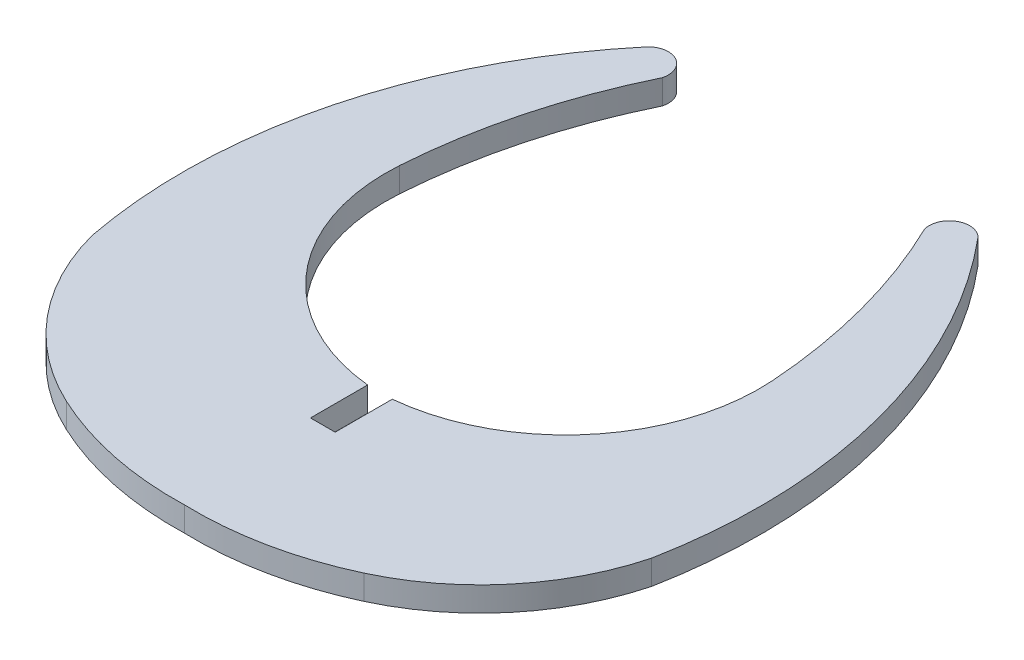
ISO-10303-21;
HEADER;
FILE_DESCRIPTION(('STEP AP214'),'2;1');
FILE_NAME('part.step','',(''),(''),'','','');
FILE_SCHEMA(('AUTOMOTIVE_DESIGN { 1 0 10303 214 1 1 1 1 }'));
ENDSEC;
DATA;
#1=APPLICATION_CONTEXT('core data for automotive mechanical design processes');
#2=APPLICATION_PROTOCOL_DEFINITION('international standard','automotive_design',2000,#1);
#3=PRODUCT_CONTEXT('',#1,'mechanical');
#4=PRODUCT('Part','Part','',(#3));
#5=PRODUCT_RELATED_PRODUCT_CATEGORY('part','',(#4));
#6=PRODUCT_DEFINITION_FORMATION('','',#4);
#7=PRODUCT_DEFINITION_CONTEXT('part definition',#1,'design');
#8=PRODUCT_DEFINITION('design','',#6,#7);
#9=PRODUCT_DEFINITION_SHAPE('','',#8);
#10=(LENGTH_UNIT() NAMED_UNIT(*) SI_UNIT(.MILLI.,.METRE.));
#11=(NAMED_UNIT(*) PLANE_ANGLE_UNIT() SI_UNIT($,.RADIAN.));
#12=(NAMED_UNIT(*) SI_UNIT($,.STERADIAN.) SOLID_ANGLE_UNIT());
#13=UNCERTAINTY_MEASURE_WITH_UNIT(LENGTH_MEASURE(1.E-05),#10,'distance_accuracy_value','');
#14=(GEOMETRIC_REPRESENTATION_CONTEXT(3) GLOBAL_UNCERTAINTY_ASSIGNED_CONTEXT((#13)) GLOBAL_UNIT_ASSIGNED_CONTEXT((#10,
#11,#12)) REPRESENTATION_CONTEXT('',''));
#15=CARTESIAN_POINT('',(0.,0.,0.));
#16=DIRECTION('',(0.,0.,1.));
#17=DIRECTION('',(1.,0.,0.));
#18=AXIS2_PLACEMENT_3D('',#15,#16,#17);
#19=CARTESIAN_POINT('',(154.28905108657,1.45,-331.360232357667));
#20=DIRECTION('',(0.,-1.,0.));
#21=DIRECTION('',(0.,0.,-1.));
#22=AXIS2_PLACEMENT_3D('',#19,#20,#21);
#23=CYLINDRICAL_SURFACE('',#22,31.366578355628);
#24=CARTESIAN_POINT('',(154.28905108657,0.,-331.360232357667));
#25=DIRECTION('',(0.,1.,0.));
#26=DIRECTION('',(0.,0.,1.));
#27=AXIS2_PLACEMENT_3D('',#24,#25,#26);
#28=CIRCLE('',#27,31.366578355628);
#29=CARTESIAN_POINT('',(185.093714546335,0.,-325.449653124599));
#30=VERTEX_POINT('',#29);
#31=CARTESIAN_POINT('',(178.321888119356,0.,-351.516744503753));
#32=VERTEX_POINT('',#31);
#33=EDGE_CURVE('E175',#30,#32,#28,.T.);
#34=ORIENTED_EDGE('',*,*,#33,.T.);
#35=DIRECTION('',(0.,-1.,0.));
#36=VECTOR('',#35,1.);
#37=CARTESIAN_POINT('',(178.321888119356,1.45,-351.516744503753));
#38=LINE('',#37,#36);
#39=CARTESIAN_POINT('',(178.321888119356,1.45,-351.516744503753));
#40=VERTEX_POINT('',#39);
#41=EDGE_CURVE('E11',#40,#32,#38,.T.);
#42=ORIENTED_EDGE('',*,*,#41,.F.);
#43=CARTESIAN_POINT('',(154.28905108657,1.45,-331.360232357667));
#44=DIRECTION('',(0.,1.,0.));
#45=DIRECTION('',(0.,0.,1.));
#46=AXIS2_PLACEMENT_3D('',#43,#44,#45);
#47=CIRCLE('',#46,31.366578355628);
#48=CARTESIAN_POINT('',(185.093714546335,1.45,-325.449653124599));
#49=VERTEX_POINT('',#48);
#50=EDGE_CURVE('E211',#49,#40,#47,.T.);
#51=ORIENTED_EDGE('',*,*,#50,.F.);
#52=DIRECTION('',(0.,-1.,0.));
#53=VECTOR('',#52,1.);
#54=CARTESIAN_POINT('',(185.093714546335,1.45,-325.449653124599));
#55=LINE('',#54,#53);
#56=EDGE_CURVE('E171',#49,#30,#55,.T.);
#57=ORIENTED_EDGE('',*,*,#56,.T.);
#58=EDGE_LOOP('',(#34,#42,#51,#57));
#59=FACE_BOUND('',#58,.T.);
#60=ADVANCED_FACE('F37',(#59),#23,.T.);
#61=CARTESIAN_POINT('',(177.470326971299,1.45,-350.675840287727));
#62=DIRECTION('',(0.,-1.,0.));
#63=DIRECTION('',(0.,0.,-1.));
#64=AXIS2_PLACEMENT_3D('',#61,#62,#63);
#65=CYLINDRICAL_SURFACE('',#64,1.19677746027014);
#66=CARTESIAN_POINT('',(177.470326971299,0.,-350.675840287727));
#67=DIRECTION('',(0.,1.,0.));
#68=DIRECTION('',(0.,0.,1.));
#69=AXIS2_PLACEMENT_3D('',#66,#67,#68);
#70=CIRCLE('',#69,1.19677746027014);
#71=CARTESIAN_POINT('',(176.313887699132,0.,-350.367742090394));
#72=VERTEX_POINT('',#71);
#73=EDGE_CURVE('E178',#32,#72,#70,.T.);
#74=ORIENTED_EDGE('',*,*,#73,.T.);
#75=DIRECTION('',(0.,-1.,0.));
#76=VECTOR('',#75,1.);
#77=CARTESIAN_POINT('',(176.313887699132,1.45,-350.367742090394));
#78=LINE('',#77,#76);
#79=CARTESIAN_POINT('',(176.313887699132,1.45,-350.367742090394));
#80=VERTEX_POINT('',#79);
#81=EDGE_CURVE('E45',#80,#72,#78,.T.);
#82=ORIENTED_EDGE('',*,*,#81,.F.);
#83=CARTESIAN_POINT('',(177.470326971299,1.45,-350.675840287727));
#84=DIRECTION('',(0.,1.,0.));
#85=DIRECTION('',(0.,0.,1.));
#86=AXIS2_PLACEMENT_3D('',#83,#84,#85);
#87=CIRCLE('',#86,1.19677746027014);
#88=EDGE_CURVE('E117',#40,#80,#87,.T.);
#89=ORIENTED_EDGE('',*,*,#88,.F.);
#90=ORIENTED_EDGE('',*,*,#41,.T.);
#91=EDGE_LOOP('',(#74,#82,#89,#90));
#92=FACE_BOUND('',#91,.T.);
#93=ADVANCED_FACE('F240',(#92),#65,.T.);
#94=CARTESIAN_POINT('',(146.282259436417,1.45,-335.798319366719));
#95=DIRECTION('',(0.,-1.,0.));
#96=DIRECTION('',(0.,0.,-1.));
#97=AXIS2_PLACEMENT_3D('',#94,#95,#96);
#98=CYLINDRICAL_SURFACE('',#97,33.379136816446);
#99=CARTESIAN_POINT('',(146.282259436417,0.,-335.798319366719));
#100=DIRECTION('',(0.,1.,0.));
#101=DIRECTION('',(0.,0.,1.));
#102=AXIS2_PLACEMENT_3D('',#99,#100,#101);
#103=CIRCLE('',#102,33.379136816446);
#104=CARTESIAN_POINT('',(179.58178791371,0.,-338.102267673646));
#105=VERTEX_POINT('',#104);
#106=EDGE_CURVE('E181',#105,#72,#103,.T.);
#107=ORIENTED_EDGE('',*,*,#106,.F.);
#108=DIRECTION('',(0.,-1.,0.));
#109=VECTOR('',#108,1.);
#110=CARTESIAN_POINT('',(179.58178791371,1.45,-338.102267673646));
#111=LINE('',#110,#109);
#112=CARTESIAN_POINT('',(179.58178791371,1.45,-338.102267673646));
#113=VERTEX_POINT('',#112);
#114=EDGE_CURVE('E233',#113,#105,#111,.T.);
#115=ORIENTED_EDGE('',*,*,#114,.F.);
#116=CARTESIAN_POINT('',(146.282259436417,1.45,-335.798319366719));
#117=DIRECTION('',(0.,1.,0.));
#118=DIRECTION('',(0.,0.,1.));
#119=AXIS2_PLACEMENT_3D('',#116,#117,#118);
#120=CIRCLE('',#119,33.379136816446);
#121=EDGE_CURVE('E239',#113,#80,#120,.T.);
#122=ORIENTED_EDGE('',*,*,#121,.T.);
#123=ORIENTED_EDGE('',*,*,#81,.T.);
#124=EDGE_LOOP('',(#107,#115,#122,#123));
#125=FACE_BOUND('',#124,.T.);
#126=ADVANCED_FACE('F237',(#125),#98,.F.);
#127=CARTESIAN_POINT('',(168.164118064278,1.45,-337.312295327684));
#128=DIRECTION('',(0.,-1.,0.));
#129=DIRECTION('',(0.,0.,-1.));
#130=AXIS2_PLACEMENT_3D('',#127,#128,#129);
#131=CYLINDRICAL_SURFACE('',#130,11.444965753466);
#132=CARTESIAN_POINT('',(168.164118064278,0.,-337.312295327684));
#133=DIRECTION('',(0.,1.,0.));
#134=DIRECTION('',(0.,0.,1.));
#135=AXIS2_PLACEMENT_3D('',#132,#133,#134);
#136=CIRCLE('',#135,11.444965753466);
#137=CARTESIAN_POINT('',(169.293804043056,0.,-325.923219391184));
#138=VERTEX_POINT('',#137);
#139=EDGE_CURVE('E184',#138,#105,#136,.T.);
#140=ORIENTED_EDGE('',*,*,#139,.F.);
#141=DIRECTION('',(0.,-1.,0.));
#142=VECTOR('',#141,1.);
#143=CARTESIAN_POINT('',(169.293804043056,1.45,-325.923219391184));
#144=LINE('',#143,#142);
#145=CARTESIAN_POINT('',(169.293804043056,1.45,-325.923219391184));
#146=VERTEX_POINT('',#145);
#147=EDGE_CURVE('E231',#146,#138,#144,.T.);
#148=ORIENTED_EDGE('',*,*,#147,.F.);
#149=CARTESIAN_POINT('',(168.164118064278,1.45,-337.312295327684));
#150=DIRECTION('',(0.,1.,0.));
#151=DIRECTION('',(0.,0.,1.));
#152=AXIS2_PLACEMENT_3D('',#149,#150,#151);
#153=CIRCLE('',#152,11.444965753466);
#154=EDGE_CURVE('E251',#146,#113,#153,.T.);
#155=ORIENTED_EDGE('',*,*,#154,.T.);
#156=ORIENTED_EDGE('',*,*,#114,.T.);
#157=EDGE_LOOP('',(#140,#148,#155,#156));
#158=FACE_BOUND('',#157,.T.);
#159=ADVANCED_FACE('F248',(#158),#131,.F.);
#160=CARTESIAN_POINT('',(169.293812051224,1.45,-266.906700255253));
#161=DIRECTION('',(-0.999999999999991,0.,1.35693665488664E-07));
#162=DIRECTION('',(1.35693665488664E-07,0.,0.999999999999991));
#163=AXIS2_PLACEMENT_3D('',#160,#161,#162);
#164=PLANE('',#163);
#165=DIRECTION('',(-1.35693665488664E-07,0.,-0.999999999999991));
#166=VECTOR('',#165,1.);
#167=CARTESIAN_POINT('',(169.293812051224,0.,-266.906700255253));
#168=LINE('',#167,#166);
#169=CARTESIAN_POINT('',(169.293804501488,0.,-322.5447855606));
#170=VERTEX_POINT('',#169);
#171=EDGE_CURVE('E187',#170,#138,#168,.T.);
#172=ORIENTED_EDGE('',*,*,#171,.F.);
#173=DIRECTION('',(0.,-1.,0.));
#174=VECTOR('',#173,1.);
#175=CARTESIAN_POINT('',(169.293804501488,1.45,-322.5447855606));
#176=LINE('',#175,#174);
#177=CARTESIAN_POINT('',(169.293804501488,1.45,-322.5447855606));
#178=VERTEX_POINT('',#177);
#179=EDGE_CURVE('E229',#178,#170,#176,.T.);
#180=ORIENTED_EDGE('',*,*,#179,.F.);
#181=DIRECTION('',(-1.35693665488664E-07,0.,-0.999999999999991));
#182=VECTOR('',#181,1.);
#183=CARTESIAN_POINT('',(169.293812051224,1.45,-266.906700255253));
#184=LINE('',#183,#182);
#185=EDGE_CURVE('E255',#178,#146,#184,.T.);
#186=ORIENTED_EDGE('',*,*,#185,.T.);
#187=ORIENTED_EDGE('',*,*,#147,.T.);
#188=EDGE_LOOP('',(#172,#180,#186,#187));
#189=FACE_BOUND('',#188,.T.);
#190=ADVANCED_FACE('F309',(#189),#164,.T.);
#191=CARTESIAN_POINT('',(-48.360559474051,1.45,-322.5447855606));
#192=DIRECTION('',(0.,0.,-1.));
#193=DIRECTION('',(-1.,0.,0.));
#194=AXIS2_PLACEMENT_3D('',#191,#192,#193);
#195=PLANE('',#194);
#196=DIRECTION('',(1.,0.,0.));
#197=VECTOR('',#196,1.);
#198=CARTESIAN_POINT('',(-48.360559474051,0.,-322.5447855606));
#199=LINE('',#198,#197);
#200=CARTESIAN_POINT('',(167.83580278802,0.,-322.5447855606));
#201=VERTEX_POINT('',#200);
#202=EDGE_CURVE('E190',#201,#170,#199,.T.);
#203=ORIENTED_EDGE('',*,*,#202,.F.);
#204=DIRECTION('',(0.,-1.,0.));
#205=VECTOR('',#204,1.);
#206=CARTESIAN_POINT('',(167.83580278802,1.45,-322.5447855606));
#207=LINE('',#206,#205);
#208=CARTESIAN_POINT('',(167.83580278802,1.45,-322.5447855606));
#209=VERTEX_POINT('',#208);
#210=EDGE_CURVE('E227',#209,#201,#207,.T.);
#211=ORIENTED_EDGE('',*,*,#210,.F.);
#212=DIRECTION('',(1.,0.,0.));
#213=VECTOR('',#212,1.);
#214=CARTESIAN_POINT('',(-48.360559474051,1.45,-322.5447855606));
#215=LINE('',#214,#213);
#216=EDGE_CURVE('E261',#209,#178,#215,.T.);
#217=ORIENTED_EDGE('',*,*,#216,.T.);
#218=ORIENTED_EDGE('',*,*,#179,.T.);
#219=EDGE_LOOP('',(#203,#211,#217,#218));
#220=FACE_BOUND('',#219,.T.);
#221=ADVANCED_FACE('F312',(#220),#195,.T.);
#222=CARTESIAN_POINT('',(167.835778870344,1.45,-266.906577782751));
#223=DIRECTION('',(-0.999999999999908,0.,-4.29878615119884E-07));
#224=DIRECTION('',(-4.29878615119884E-07,0.,0.999999999999908));
#225=AXIS2_PLACEMENT_3D('',#222,#223,#224);
#226=PLANE('',#225);
#227=DIRECTION('',(4.29878615119883E-07,0.,-0.999999999999908));
#228=VECTOR('',#227,1.);
#229=CARTESIAN_POINT('',(167.835778870344,0.,-266.906577782751));
#230=LINE('',#229,#228);
#231=CARTESIAN_POINT('',(167.835804240336,0.,-325.923219338646));
#232=VERTEX_POINT('',#231);
#233=EDGE_CURVE('E193',#201,#232,#230,.T.);
#234=ORIENTED_EDGE('',*,*,#233,.T.);
#235=DIRECTION('',(0.,-1.,0.));
#236=VECTOR('',#235,1.);
#237=CARTESIAN_POINT('',(167.835804240336,1.45,-325.923219338646));
#238=LINE('',#237,#236);
#239=CARTESIAN_POINT('',(167.835804240336,1.45,-325.923219338646));
#240=VERTEX_POINT('',#239);
#241=EDGE_CURVE('E225',#240,#232,#238,.T.);
#242=ORIENTED_EDGE('',*,*,#241,.F.);
#243=DIRECTION('',(4.29878615119883E-07,0.,-0.999999999999908));
#244=VECTOR('',#243,1.);
#245=CARTESIAN_POINT('',(167.835778870344,1.45,-266.906577782751));
#246=LINE('',#245,#244);
#247=EDGE_CURVE('E264',#209,#240,#246,.T.);
#248=ORIENTED_EDGE('',*,*,#247,.F.);
#249=ORIENTED_EDGE('',*,*,#210,.T.);
#250=EDGE_LOOP('',(#234,#242,#248,#249));
#251=FACE_BOUND('',#250,.T.);
#252=ADVANCED_FACE('F316',(#251),#226,.F.);
#253=CARTESIAN_POINT('',(168.965489038035,1.45,-337.312295392298));
#254=DIRECTION('',(0.,-1.,0.));
#255=DIRECTION('',(0.,0.,-1.));
#256=AXIS2_PLACEMENT_3D('',#253,#254,#255);
#257=CYLINDRICAL_SURFACE('',#256,11.444965753466);
#258=CARTESIAN_POINT('',(168.965489038035,0.,-337.312295392298));
#259=DIRECTION('',(0.,1.,0.));
#260=DIRECTION('',(0.,0.,1.));
#261=AXIS2_PLACEMENT_3D('',#258,#259,#260);
#262=CIRCLE('',#261,11.444965753466);
#263=CARTESIAN_POINT('',(157.547819028588,0.,-338.102265425526));
#264=VERTEX_POINT('',#263);
#265=EDGE_CURVE('E196',#264,#232,#262,.T.);
#266=ORIENTED_EDGE('',*,*,#265,.F.);
#267=DIRECTION('',(0.,-1.,0.));
#268=VECTOR('',#267,1.);
#269=CARTESIAN_POINT('',(157.547819028588,1.45,-338.102265425526));
#270=LINE('',#269,#268);
#271=CARTESIAN_POINT('',(157.547819028588,1.45,-338.102265425526));
#272=VERTEX_POINT('',#271);
#273=EDGE_CURVE('E223',#272,#264,#270,.T.);
#274=ORIENTED_EDGE('',*,*,#273,.F.);
#275=CARTESIAN_POINT('',(168.965489038035,1.45,-337.312295392298));
#276=DIRECTION('',(0.,1.,0.));
#277=DIRECTION('',(0.,0.,1.));
#278=AXIS2_PLACEMENT_3D('',#275,#276,#277);
#279=CIRCLE('',#278,11.444965753466);
#280=EDGE_CURVE('E266',#272,#240,#279,.T.);
#281=ORIENTED_EDGE('',*,*,#280,.T.);
#282=ORIENTED_EDGE('',*,*,#241,.T.);
#283=EDGE_LOOP('',(#266,#274,#281,#282));
#284=FACE_BOUND('',#283,.T.);
#285=ADVANCED_FACE('F320',(#284),#257,.F.);
#286=CARTESIAN_POINT('',(190.84734767368,1.45,-335.79831954384));
#287=DIRECTION('',(0.,-1.,0.));
#288=DIRECTION('',(0.,0.,-1.));
#289=AXIS2_PLACEMENT_3D('',#286,#287,#288);
#290=CYLINDRICAL_SURFACE('',#289,33.379136816446);
#291=CARTESIAN_POINT('',(190.84734767368,0.,-335.79831954384));
#292=DIRECTION('',(0.,1.,0.));
#293=DIRECTION('',(0.,0.,1.));
#294=AXIS2_PLACEMENT_3D('',#291,#292,#293);
#295=CIRCLE('',#294,33.379136816446);
#296=CARTESIAN_POINT('',(160.815718075954,0.,-350.367739515686));
#297=VERTEX_POINT('',#296);
#298=EDGE_CURVE('E199',#297,#264,#295,.T.);
#299=ORIENTED_EDGE('',*,*,#298,.F.);
#300=DIRECTION('',(0.,-1.,0.));
#301=VECTOR('',#300,1.);
#302=CARTESIAN_POINT('',(160.815718075954,1.45,-350.367739515686));
#303=LINE('',#302,#301);
#304=CARTESIAN_POINT('',(160.815718075954,1.45,-350.367739515686));
#305=VERTEX_POINT('',#304);
#306=EDGE_CURVE('E221',#305,#297,#303,.T.);
#307=ORIENTED_EDGE('',*,*,#306,.F.);
#308=CARTESIAN_POINT('',(190.84734767368,1.45,-335.79831954384));
#309=DIRECTION('',(0.,1.,0.));
#310=DIRECTION('',(0.,0.,1.));
#311=AXIS2_PLACEMENT_3D('',#308,#309,#310);
#312=CIRCLE('',#311,33.379136816446);
#313=EDGE_CURVE('E269',#305,#272,#312,.T.);
#314=ORIENTED_EDGE('',*,*,#313,.T.);
#315=ORIENTED_EDGE('',*,*,#273,.T.);
#316=EDGE_LOOP('',(#299,#307,#314,#315));
#317=FACE_BOUND('',#316,.T.);
#318=ADVANCED_FACE('F324',(#317),#290,.F.);
#319=CARTESIAN_POINT('',(159.659279760398,1.45,-350.675839957962));
#320=DIRECTION('',(0.,-1.,0.));
#321=DIRECTION('',(0.,0.,-1.));
#322=AXIS2_PLACEMENT_3D('',#319,#320,#321);
#323=CYLINDRICAL_SURFACE('',#322,1.19677711384269);
#324=CARTESIAN_POINT('',(159.659279760398,0.,-350.675839957962));
#325=DIRECTION('',(0.,1.,0.));
#326=DIRECTION('',(0.,0.,1.));
#327=AXIS2_PLACEMENT_3D('',#324,#325,#326);
#328=CIRCLE('',#327,1.19677711384269);
#329=CARTESIAN_POINT('',(158.807718870456,0.,-351.516743942337));
#330=VERTEX_POINT('',#329);
#331=EDGE_CURVE('E202',#297,#330,#328,.T.);
#332=ORIENTED_EDGE('',*,*,#331,.T.);
#333=DIRECTION('',(0.,-1.,0.));
#334=VECTOR('',#333,1.);
#335=CARTESIAN_POINT('',(158.807718870456,1.45,-351.516743942337));
#336=LINE('',#335,#334);
#337=CARTESIAN_POINT('',(158.807718870456,1.45,-351.516743942337));
#338=VERTEX_POINT('',#337);
#339=EDGE_CURVE('E218',#338,#330,#336,.T.);
#340=ORIENTED_EDGE('',*,*,#339,.F.);
#341=CARTESIAN_POINT('',(159.659279760398,1.45,-350.675839957962));
#342=DIRECTION('',(0.,1.,0.));
#343=DIRECTION('',(0.,0.,1.));
#344=AXIS2_PLACEMENT_3D('',#341,#342,#343);
#345=CIRCLE('',#344,1.19677711384269);
#346=EDGE_CURVE('E272',#305,#338,#345,.T.);
#347=ORIENTED_EDGE('',*,*,#346,.F.);
#348=ORIENTED_EDGE('',*,*,#306,.T.);
#349=EDGE_LOOP('',(#332,#340,#347,#348));
#350=FACE_BOUND('',#349,.T.);
#351=ADVANCED_FACE('F328',(#350),#323,.T.);
#352=CARTESIAN_POINT('',(182.840556044685,1.45,-331.360231964896));
#353=DIRECTION('',(0.,-1.,0.));
#354=DIRECTION('',(0.,0.,-1.));
#355=AXIS2_PLACEMENT_3D('',#352,#353,#354);
#356=CYLINDRICAL_SURFACE('',#355,31.366578355628);
#357=CARTESIAN_POINT('',(182.840556044685,0.,-331.360231964896));
#358=DIRECTION('',(0.,1.,0.));
#359=DIRECTION('',(0.,0.,1.));
#360=AXIS2_PLACEMENT_3D('',#357,#358,#359);
#361=CIRCLE('',#360,31.366578355628);
#362=CARTESIAN_POINT('',(152.035893099639,0.,-325.449650049226));
#363=VERTEX_POINT('',#362);
#364=EDGE_CURVE('E204',#330,#363,#361,.T.);
#365=ORIENTED_EDGE('',*,*,#364,.T.);
#366=DIRECTION('',(0.,-1.,0.));
#367=VECTOR('',#366,1.);
#368=CARTESIAN_POINT('',(152.035893099639,1.45,-325.449650049226));
#369=LINE('',#368,#367);
#370=CARTESIAN_POINT('',(152.035893099639,1.45,-325.449650049226));
#371=VERTEX_POINT('',#370);
#372=EDGE_CURVE('E215',#371,#363,#369,.T.);
#373=ORIENTED_EDGE('',*,*,#372,.F.);
#374=CARTESIAN_POINT('',(182.840556044685,1.45,-331.360231964896));
#375=DIRECTION('',(0.,1.,0.));
#376=DIRECTION('',(0.,0.,1.));
#377=AXIS2_PLACEMENT_3D('',#374,#375,#376);
#378=CIRCLE('',#377,31.366578355628);
#379=EDGE_CURVE('E274',#338,#371,#378,.T.);
#380=ORIENTED_EDGE('',*,*,#379,.F.);
#381=ORIENTED_EDGE('',*,*,#339,.T.);
#382=EDGE_LOOP('',(#365,#373,#380,#381));
#383=FACE_BOUND('',#382,.T.);
#384=ADVANCED_FACE('F281',(#383),#356,.T.);
#385=CARTESIAN_POINT('',(165.777491793222,1.45,-329.059297571161));
#386=DIRECTION('',(0.,-1.,0.));
#387=DIRECTION('',(0.,0.,-1.));
#388=AXIS2_PLACEMENT_3D('',#385,#386,#387);
#389=CYLINDRICAL_SURFACE('',#388,14.207782722441);
#390=CARTESIAN_POINT('',(165.777491793222,0.,-329.059297571161));
#391=DIRECTION('',(0.,1.,0.));
#392=DIRECTION('',(0.,0.,1.));
#393=AXIS2_PLACEMENT_3D('',#390,#391,#392);
#394=CIRCLE('',#393,14.207782722441);
#395=CARTESIAN_POINT('',(159.773354147678,0.,-316.182519207709));
#396=VERTEX_POINT('',#395);
#397=EDGE_CURVE('E206',#363,#396,#394,.T.);
#398=ORIENTED_EDGE('',*,*,#397,.T.);
#399=DIRECTION('',(0.,-1.,0.));
#400=VECTOR('',#399,1.);
#401=CARTESIAN_POINT('',(159.773354147678,1.45,-316.182519207709));
#402=LINE('',#401,#400);
#403=CARTESIAN_POINT('',(159.773354147678,1.45,-316.182519207709));
#404=VERTEX_POINT('',#403);
#405=EDGE_CURVE('E166',#404,#396,#402,.T.);
#406=ORIENTED_EDGE('',*,*,#405,.F.);
#407=CARTESIAN_POINT('',(165.777491793222,1.45,-329.059297571161));
#408=DIRECTION('',(0.,1.,0.));
#409=DIRECTION('',(0.,0.,1.));
#410=AXIS2_PLACEMENT_3D('',#407,#408,#409);
#411=CIRCLE('',#410,14.207782722441);
#412=EDGE_CURVE('E157',#371,#404,#411,.T.);
#413=ORIENTED_EDGE('',*,*,#412,.F.);
#414=ORIENTED_EDGE('',*,*,#372,.T.);
#415=EDGE_LOOP('',(#398,#406,#413,#414));
#416=FACE_BOUND('',#415,.T.);
#417=ADVANCED_FACE('F285',(#416),#389,.T.);
#418=CARTESIAN_POINT('',(167.979183168411,1.45,-333.781157671282));
#419=DIRECTION('',(0.,-1.,0.));
#420=DIRECTION('',(0.,0.,-1.));
#421=AXIS2_PLACEMENT_3D('',#418,#419,#420);
#422=CYLINDRICAL_SURFACE('',#421,19.417716284081);
#423=CARTESIAN_POINT('',(167.979183168411,0.,-333.781157671282));
#424=DIRECTION('',(0.,1.,0.));
#425=DIRECTION('',(0.,0.,1.));
#426=AXIS2_PLACEMENT_3D('',#423,#424,#425);
#427=CIRCLE('',#426,19.417716284081);
#428=CARTESIAN_POINT('',(168.564802729558,0.,-314.372274256241));
#429=VERTEX_POINT('',#428);
#430=EDGE_CURVE('E165',#396,#429,#427,.T.);
#431=ORIENTED_EDGE('',*,*,#430,.T.);
#432=DIRECTION('',(0.,-1.,0.));
#433=VECTOR('',#432,1.);
#434=CARTESIAN_POINT('',(168.564802729558,1.45,-314.372274256241));
#435=LINE('',#434,#433);
#436=CARTESIAN_POINT('',(168.564802729558,1.45,-314.372274256241));
#437=VERTEX_POINT('',#436);
#438=EDGE_CURVE('E162',#437,#429,#435,.T.);
#439=ORIENTED_EDGE('',*,*,#438,.F.);
#440=CARTESIAN_POINT('',(167.979183168411,1.45,-333.781157671282));
#441=DIRECTION('',(0.,1.,0.));
#442=DIRECTION('',(0.,0.,1.));
#443=AXIS2_PLACEMENT_3D('',#440,#441,#442);
#444=CIRCLE('',#443,19.417716284081);
#445=EDGE_CURVE('E151',#404,#437,#444,.T.);
#446=ORIENTED_EDGE('',*,*,#445,.F.);
#447=ORIENTED_EDGE('',*,*,#405,.T.);
#448=EDGE_LOOP('',(#431,#439,#446,#447));
#449=FACE_BOUND('',#448,.T.);
#450=ADVANCED_FACE('F163',(#449),#422,.T.);
#451=CARTESIAN_POINT('',(169.150423507587,1.45,-333.781157634566));
#452=DIRECTION('',(0.,-1.,0.));
#453=DIRECTION('',(0.,0.,-1.));
#454=AXIS2_PLACEMENT_3D('',#451,#452,#453);
#455=CYLINDRICAL_SURFACE('',#454,19.417716284082);
#456=CARTESIAN_POINT('',(169.150423507587,0.,-333.781157634566));
#457=DIRECTION('',(0.,1.,0.));
#458=DIRECTION('',(0.,0.,1.));
#459=AXIS2_PLACEMENT_3D('',#456,#457,#458);
#460=CIRCLE('',#459,19.417716284082);
#461=CARTESIAN_POINT('',(177.356251763318,0.,-316.182518814289));
#462=VERTEX_POINT('',#461);
#463=EDGE_CURVE('E103',#429,#462,#460,.T.);
#464=ORIENTED_EDGE('',*,*,#463,.T.);
#465=DIRECTION('',(0.,-1.,0.));
#466=VECTOR('',#465,1.);
#467=CARTESIAN_POINT('',(177.356251763318,1.45,-316.182518814289));
#468=LINE('',#467,#466);
#469=CARTESIAN_POINT('',(177.356251763318,1.45,-316.182518814289));
#470=VERTEX_POINT('',#469);
#471=EDGE_CURVE('E167',#470,#462,#468,.T.);
#472=ORIENTED_EDGE('',*,*,#471,.F.);
#473=CARTESIAN_POINT('',(169.150423507587,1.45,-333.781157634566));
#474=DIRECTION('',(0.,1.,0.));
#475=DIRECTION('',(0.,0.,1.));
#476=AXIS2_PLACEMENT_3D('',#473,#474,#475);
#477=CIRCLE('',#476,19.417716284082);
#478=EDGE_CURVE('E155',#437,#470,#477,.T.);
#479=ORIENTED_EDGE('',*,*,#478,.F.);
#480=ORIENTED_EDGE('',*,*,#438,.T.);
#481=EDGE_LOOP('',(#464,#472,#479,#480));
#482=FACE_BOUND('',#481,.T.);
#483=ADVANCED_FACE('F169',(#482),#455,.T.);
#484=CARTESIAN_POINT('',(171.352115262604,1.45,-329.05929744343));
#485=DIRECTION('',(0.,-1.,0.));
#486=DIRECTION('',(0.,0.,-1.));
#487=AXIS2_PLACEMENT_3D('',#484,#485,#486);
#488=CYLINDRICAL_SURFACE('',#487,14.207782479441);
#489=CARTESIAN_POINT('',(171.352115262604,0.,-329.05929744343));
#490=DIRECTION('',(0.,1.,0.));
#491=DIRECTION('',(0.,0.,1.));
#492=AXIS2_PLACEMENT_3D('',#489,#490,#491);
#493=CIRCLE('',#492,14.207782479441);
#494=EDGE_CURVE('E109',#462,#30,#493,.T.);
#495=ORIENTED_EDGE('',*,*,#494,.T.);
#496=ORIENTED_EDGE('',*,*,#56,.F.);
#497=CARTESIAN_POINT('',(171.352115262604,1.45,-329.05929744343));
#498=DIRECTION('',(0.,1.,0.));
#499=DIRECTION('',(0.,0.,1.));
#500=AXIS2_PLACEMENT_3D('',#497,#498,#499);
#501=CIRCLE('',#500,14.207782479441);
#502=EDGE_CURVE('E53',#470,#49,#501,.T.);
#503=ORIENTED_EDGE('',*,*,#502,.F.);
#504=ORIENTED_EDGE('',*,*,#471,.T.);
#505=EDGE_LOOP('',(#495,#496,#503,#504));
#506=FACE_BOUND('',#505,.T.);
#507=ADVANCED_FACE('F288',(#506),#488,.T.);
#508=CARTESIAN_POINT('',(-48.360559474051,1.45,-266.906670720934));
#509=DIRECTION('',(0.,1.,0.));
#510=DIRECTION('',(0.,0.,1.));
#511=AXIS2_PLACEMENT_3D('',#508,#509,#510);
#512=PLANE('',#511);
#513=ORIENTED_EDGE('',*,*,#50,.T.);
#514=ORIENTED_EDGE('',*,*,#88,.T.);
#515=ORIENTED_EDGE('',*,*,#121,.F.);
#516=ORIENTED_EDGE('',*,*,#154,.F.);
#517=ORIENTED_EDGE('',*,*,#185,.F.);
#518=ORIENTED_EDGE('',*,*,#216,.F.);
#519=ORIENTED_EDGE('',*,*,#247,.T.);
#520=ORIENTED_EDGE('',*,*,#280,.F.);
#521=ORIENTED_EDGE('',*,*,#313,.F.);
#522=ORIENTED_EDGE('',*,*,#346,.T.);
#523=ORIENTED_EDGE('',*,*,#379,.T.);
#524=ORIENTED_EDGE('',*,*,#412,.T.);
#525=ORIENTED_EDGE('',*,*,#445,.T.);
#526=ORIENTED_EDGE('',*,*,#478,.T.);
#527=ORIENTED_EDGE('',*,*,#502,.T.);
#528=EDGE_LOOP('',(#513,#514,#515,#516,#517,#518,#519,#520,#521,#522,#523,#524,#525,#526,#527));
#529=FACE_BOUND('',#528,.T.);
#530=ADVANCED_FACE('F153',(#529),#512,.T.);
#531=CARTESIAN_POINT('',(-48.360559474051,0.,-266.906670720934));
#532=DIRECTION('',(0.,1.,0.));
#533=DIRECTION('',(0.,0.,1.));
#534=AXIS2_PLACEMENT_3D('',#531,#532,#533);
#535=PLANE('',#534);
#536=ORIENTED_EDGE('',*,*,#33,.F.);
#537=ORIENTED_EDGE('',*,*,#494,.F.);
#538=ORIENTED_EDGE('',*,*,#463,.F.);
#539=ORIENTED_EDGE('',*,*,#430,.F.);
#540=ORIENTED_EDGE('',*,*,#397,.F.);
#541=ORIENTED_EDGE('',*,*,#364,.F.);
#542=ORIENTED_EDGE('',*,*,#331,.F.);
#543=ORIENTED_EDGE('',*,*,#298,.T.);
#544=ORIENTED_EDGE('',*,*,#265,.T.);
#545=ORIENTED_EDGE('',*,*,#233,.F.);
#546=ORIENTED_EDGE('',*,*,#202,.T.);
#547=ORIENTED_EDGE('',*,*,#171,.T.);
#548=ORIENTED_EDGE('',*,*,#139,.T.);
#549=ORIENTED_EDGE('',*,*,#106,.T.);
#550=ORIENTED_EDGE('',*,*,#73,.F.);
#551=EDGE_LOOP('',(#536,#537,#538,#539,#540,#541,#542,#543,#544,#545,#546,#547,#548,#549,#550));
#552=FACE_BOUND('',#551,.T.);
#553=ADVANCED_FACE('F244',(#552),#535,.F.);
#554=CLOSED_SHELL('',(#60,#93,#126,#159,#190,#221,#252,#285,#318,#351,#384,#417,#450,#483,#507,
#530,#553));
#555=MANIFOLD_SOLID_BREP('B2',#554);
#556=ADVANCED_BREP_SHAPE_REPRESENTATION('',(#18,#555),#14);
#557=SHAPE_DEFINITION_REPRESENTATION(#9,#556);
ENDSEC;
END-ISO-10303-21;
